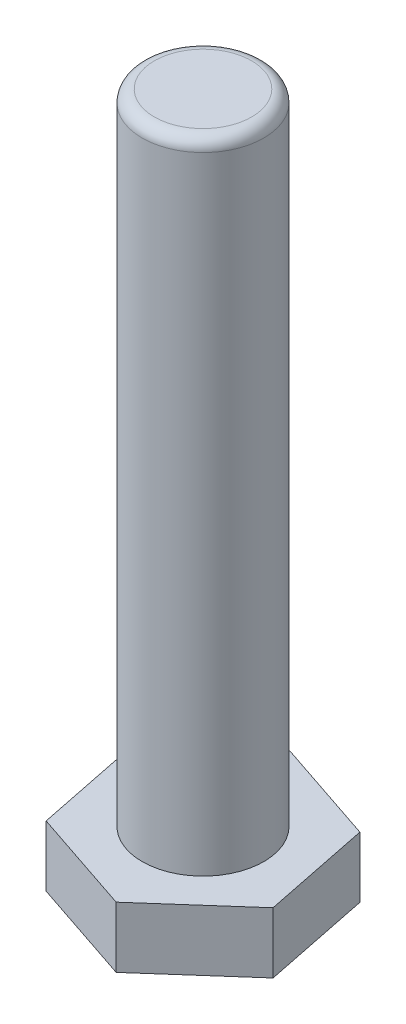
ISO-10303-21;
HEADER;
FILE_DESCRIPTION(('STEP AP214'),'2;1');
FILE_NAME('part.step','',(''),(''),'','','');
FILE_SCHEMA(('AUTOMOTIVE_DESIGN { 1 0 10303 214 1 1 1 1 }'));
ENDSEC;
DATA;
#1=APPLICATION_CONTEXT('core data for automotive mechanical design processes');
#2=APPLICATION_PROTOCOL_DEFINITION('international standard','automotive_design',2000,#1);
#3=PRODUCT_CONTEXT('',#1,'mechanical');
#4=PRODUCT('Part','Part','',(#3));
#5=PRODUCT_RELATED_PRODUCT_CATEGORY('part','',(#4));
#6=PRODUCT_DEFINITION_FORMATION('','',#4);
#7=PRODUCT_DEFINITION_CONTEXT('part definition',#1,'design');
#8=PRODUCT_DEFINITION('design','',#6,#7);
#9=PRODUCT_DEFINITION_SHAPE('','',#8);
#10=(LENGTH_UNIT() NAMED_UNIT(*) SI_UNIT(.MILLI.,.METRE.));
#11=(NAMED_UNIT(*) PLANE_ANGLE_UNIT() SI_UNIT($,.RADIAN.));
#12=(NAMED_UNIT(*) SI_UNIT($,.STERADIAN.) SOLID_ANGLE_UNIT());
#13=UNCERTAINTY_MEASURE_WITH_UNIT(LENGTH_MEASURE(1.E-05),#10,'distance_accuracy_value','');
#14=(GEOMETRIC_REPRESENTATION_CONTEXT(3) GLOBAL_UNCERTAINTY_ASSIGNED_CONTEXT((#13)) GLOBAL_UNIT_ASSIGNED_CONTEXT((#10,
#11,#12)) REPRESENTATION_CONTEXT('',''));
#15=CARTESIAN_POINT('',(0.,0.,0.));
#16=DIRECTION('',(0.,0.,1.));
#17=DIRECTION('',(1.,0.,0.));
#18=AXIS2_PLACEMENT_3D('',#15,#16,#17);
#19=CARTESIAN_POINT('',(-17.3205080756888,10.,-5.8073031005664));
#20=DIRECTION('',(0.980048111294351,0.,-0.198760407396384));
#21=DIRECTION('',(-0.198760407396384,0.,-0.980048111294351));
#22=AXIS2_PLACEMENT_3D('',#19,#20,#21);
#23=PLANE('',#22);
#24=DIRECTION('',(0.198760407396384,0.,0.980048111294351));
#25=VECTOR('',#24,1.);
#26=CARTESIAN_POINT('',(-17.3205080756888,0.,-5.8073031005664));
#27=LINE('',#26,#25);
#28=CARTESIAN_POINT('',(-17.3205080756888,0.,-5.8073031005664));
#29=VERTEX_POINT('',#28);
#30=CARTESIAN_POINT('',(-13.689526050411,0.,12.0963484497168));
#31=VERTEX_POINT('',#30);
#32=EDGE_CURVE('E122',#29,#31,#27,.T.);
#33=ORIENTED_EDGE('',*,*,#32,.T.);
#34=DIRECTION('',(0.,-1.,0.));
#35=VECTOR('',#34,1.);
#36=CARTESIAN_POINT('',(-13.689526050411,10.,12.0963484497168));
#37=LINE('',#36,#35);
#38=CARTESIAN_POINT('',(-13.689526050411,10.,12.0963484497168));
#39=VERTEX_POINT('',#38);
#40=EDGE_CURVE('E139',#39,#31,#37,.T.);
#41=ORIENTED_EDGE('',*,*,#40,.F.);
#42=DIRECTION('',(0.198760407396384,0.,0.980048111294351));
#43=VECTOR('',#42,1.);
#44=CARTESIAN_POINT('',(-17.3205080756888,10.,-5.8073031005664));
#45=LINE('',#44,#43);
#46=CARTESIAN_POINT('',(-17.3205080756888,10.,-5.8073031005664));
#47=VERTEX_POINT('',#46);
#48=EDGE_CURVE('E132',#47,#39,#45,.T.);
#49=ORIENTED_EDGE('',*,*,#48,.F.);
#50=DIRECTION('',(0.,-1.,0.));
#51=VECTOR('',#50,1.);
#52=CARTESIAN_POINT('',(-17.3205080756888,10.,-5.8073031005664));
#53=LINE('',#52,#51);
#54=EDGE_CURVE('E118',#47,#29,#53,.T.);
#55=ORIENTED_EDGE('',*,*,#54,.T.);
#56=EDGE_LOOP('',(#33,#41,#49,#55));
#57=FACE_BOUND('',#56,.T.);
#58=ADVANCED_FACE('F36',(#57),#23,.F.);
#59=CARTESIAN_POINT('',(-13.689526050411,10.,12.0963484497168));
#60=DIRECTION('',(0.317892493575363,0.,-0.948126765010058));
#61=DIRECTION('',(-0.948126765010058,0.,-0.317892493575363));
#62=AXIS2_PLACEMENT_3D('',#59,#60,#61);
#63=PLANE('',#62);
#64=DIRECTION('',(0.948126765010058,0.,0.317892493575363));
#65=VECTOR('',#64,1.);
#66=CARTESIAN_POINT('',(-13.689526050411,0.,12.0963484497168));
#67=LINE('',#66,#65);
#68=CARTESIAN_POINT('',(3.63098202527774,0.,17.9036515502832));
#69=VERTEX_POINT('',#68);
#70=EDGE_CURVE('E125',#31,#69,#67,.T.);
#71=ORIENTED_EDGE('',*,*,#70,.T.);
#72=DIRECTION('',(0.,-1.,0.));
#73=VECTOR('',#72,1.);
#74=CARTESIAN_POINT('',(3.63098202527774,10.,17.9036515502832));
#75=LINE('',#74,#73);
#76=CARTESIAN_POINT('',(3.63098202527774,10.,17.9036515502832));
#77=VERTEX_POINT('',#76);
#78=EDGE_CURVE('E136',#77,#69,#75,.T.);
#79=ORIENTED_EDGE('',*,*,#78,.F.);
#80=DIRECTION('',(0.948126765010058,0.,0.317892493575363));
#81=VECTOR('',#80,1.);
#82=CARTESIAN_POINT('',(-13.689526050411,10.,12.0963484497168));
#83=LINE('',#82,#81);
#84=EDGE_CURVE('E91',#39,#77,#83,.T.);
#85=ORIENTED_EDGE('',*,*,#84,.F.);
#86=ORIENTED_EDGE('',*,*,#40,.T.);
#87=EDGE_LOOP('',(#71,#79,#85,#86));
#88=FACE_BOUND('',#87,.T.);
#89=ADVANCED_FACE('F152',(#88),#63,.F.);
#90=CARTESIAN_POINT('',(3.63098202527774,10.,17.9036515502832));
#91=DIRECTION('',(-0.662155617718988,0.,-0.749366357613674));
#92=DIRECTION('',(-0.749366357613674,0.,0.662155617718988));
#93=AXIS2_PLACEMENT_3D('',#90,#91,#92);
#94=PLANE('',#93);
#95=DIRECTION('',(0.749366357613674,0.,-0.662155617718988));
#96=VECTOR('',#95,1.);
#97=CARTESIAN_POINT('',(3.63098202527774,0.,17.9036515502832));
#98=LINE('',#97,#96);
#99=CARTESIAN_POINT('',(17.3205080756888,0.,5.80730310056641));
#100=VERTEX_POINT('',#99);
#101=EDGE_CURVE('E127',#69,#100,#98,.T.);
#102=ORIENTED_EDGE('',*,*,#101,.T.);
#103=DIRECTION('',(0.,-1.,0.));
#104=VECTOR('',#103,1.);
#105=CARTESIAN_POINT('',(17.3205080756888,10.,5.80730310056641));
#106=LINE('',#105,#104);
#107=CARTESIAN_POINT('',(17.3205080756888,10.,5.80730310056641));
#108=VERTEX_POINT('',#107);
#109=EDGE_CURVE('E113',#108,#100,#106,.T.);
#110=ORIENTED_EDGE('',*,*,#109,.F.);
#111=DIRECTION('',(0.749366357613674,0.,-0.662155617718988));
#112=VECTOR('',#111,1.);
#113=CARTESIAN_POINT('',(3.63098202527774,10.,17.9036515502832));
#114=LINE('',#113,#112);
#115=EDGE_CURVE('E104',#77,#108,#114,.T.);
#116=ORIENTED_EDGE('',*,*,#115,.F.);
#117=ORIENTED_EDGE('',*,*,#78,.T.);
#118=EDGE_LOOP('',(#102,#110,#116,#117));
#119=FACE_BOUND('',#118,.T.);
#120=ADVANCED_FACE('F155',(#119),#94,.F.);
#121=CARTESIAN_POINT('',(17.3205080756888,10.,5.80730310056641));
#122=DIRECTION('',(-0.980048111294351,0.,0.198760407396383));
#123=DIRECTION('',(0.198760407396383,0.,0.980048111294351));
#124=AXIS2_PLACEMENT_3D('',#121,#122,#123);
#125=PLANE('',#124);
#126=DIRECTION('',(-0.198760407396383,0.,-0.98004811129435));
#127=VECTOR('',#126,1.);
#128=CARTESIAN_POINT('',(17.3205080756888,0.,5.80730310056641));
#129=LINE('',#128,#127);
#130=CARTESIAN_POINT('',(13.689526050411,0.,-12.0963484497168));
#131=VERTEX_POINT('',#130);
#132=EDGE_CURVE('E112',#100,#131,#129,.T.);
#133=ORIENTED_EDGE('',*,*,#132,.T.);
#134=DIRECTION('',(0.,-1.,0.));
#135=VECTOR('',#134,1.);
#136=CARTESIAN_POINT('',(13.689526050411,10.,-12.0963484497168));
#137=LINE('',#136,#135);
#138=CARTESIAN_POINT('',(13.689526050411,10.,-12.0963484497168));
#139=VERTEX_POINT('',#138);
#140=EDGE_CURVE('E109',#139,#131,#137,.T.);
#141=ORIENTED_EDGE('',*,*,#140,.F.);
#142=DIRECTION('',(-0.198760407396383,0.,-0.98004811129435));
#143=VECTOR('',#142,1.);
#144=CARTESIAN_POINT('',(17.3205080756888,10.,5.80730310056641));
#145=LINE('',#144,#143);
#146=EDGE_CURVE('E98',#108,#139,#145,.T.);
#147=ORIENTED_EDGE('',*,*,#146,.F.);
#148=ORIENTED_EDGE('',*,*,#109,.T.);
#149=EDGE_LOOP('',(#133,#141,#147,#148));
#150=FACE_BOUND('',#149,.T.);
#151=ADVANCED_FACE('F110',(#150),#125,.F.);
#152=CARTESIAN_POINT('',(13.689526050411,10.,-12.0963484497168));
#153=DIRECTION('',(-0.317892493575362,0.,0.948126765010058));
#154=DIRECTION('',(0.948126765010058,0.,0.317892493575362));
#155=AXIS2_PLACEMENT_3D('',#152,#153,#154);
#156=PLANE('',#155);
#157=DIRECTION('',(-0.948126765010058,0.,-0.317892493575362));
#158=VECTOR('',#157,1.);
#159=CARTESIAN_POINT('',(13.689526050411,0.,-12.0963484497168));
#160=LINE('',#159,#158);
#161=CARTESIAN_POINT('',(-3.63098202527775,0.,-17.9036515502832));
#162=VERTEX_POINT('',#161);
#163=EDGE_CURVE('E76',#131,#162,#160,.T.);
#164=ORIENTED_EDGE('',*,*,#163,.T.);
#165=DIRECTION('',(0.,-1.,0.));
#166=VECTOR('',#165,1.);
#167=CARTESIAN_POINT('',(-3.63098202527775,10.,-17.9036515502832));
#168=LINE('',#167,#166);
#169=CARTESIAN_POINT('',(-3.63098202527775,10.,-17.9036515502832));
#170=VERTEX_POINT('',#169);
#171=EDGE_CURVE('E114',#170,#162,#168,.T.);
#172=ORIENTED_EDGE('',*,*,#171,.F.);
#173=DIRECTION('',(-0.948126765010058,0.,-0.317892493575362));
#174=VECTOR('',#173,1.);
#175=CARTESIAN_POINT('',(13.689526050411,10.,-12.0963484497168));
#176=LINE('',#175,#174);
#177=EDGE_CURVE('E102',#139,#170,#176,.T.);
#178=ORIENTED_EDGE('',*,*,#177,.F.);
#179=ORIENTED_EDGE('',*,*,#140,.T.);
#180=EDGE_LOOP('',(#164,#172,#178,#179));
#181=FACE_BOUND('',#180,.T.);
#182=ADVANCED_FACE('F116',(#181),#156,.F.);
#183=CARTESIAN_POINT('',(-3.63098202527775,10.,-17.9036515502832));
#184=DIRECTION('',(0.662155617718988,0.,0.749366357613674));
#185=DIRECTION('',(0.749366357613674,0.,-0.662155617718988));
#186=AXIS2_PLACEMENT_3D('',#183,#184,#185);
#187=PLANE('',#186);
#188=DIRECTION('',(-0.749366357613674,0.,0.662155617718988));
#189=VECTOR('',#188,1.);
#190=CARTESIAN_POINT('',(-3.63098202527775,0.,-17.9036515502832));
#191=LINE('',#190,#189);
#192=EDGE_CURVE('E82',#162,#29,#191,.T.);
#193=ORIENTED_EDGE('',*,*,#192,.T.);
#194=ORIENTED_EDGE('',*,*,#54,.F.);
#195=DIRECTION('',(-0.749366357613674,0.,0.662155617718988));
#196=VECTOR('',#195,1.);
#197=CARTESIAN_POINT('',(-3.63098202527775,10.,-17.9036515502832));
#198=LINE('',#197,#196);
#199=EDGE_CURVE('E53',#170,#47,#198,.T.);
#200=ORIENTED_EDGE('',*,*,#199,.F.);
#201=ORIENTED_EDGE('',*,*,#171,.T.);
#202=EDGE_LOOP('',(#193,#194,#200,#201));
#203=FACE_BOUND('',#202,.T.);
#204=ADVANCED_FACE('F160',(#203),#187,.F.);
#205=CARTESIAN_POINT('',(0.,10.,0.));
#206=DIRECTION('',(0.,1.,0.));
#207=DIRECTION('',(0.,0.,1.));
#208=AXIS2_PLACEMENT_3D('',#205,#206,#207);
#209=PLANE('',#208);
#210=CARTESIAN_POINT('',(0.,10.,0.));
#211=DIRECTION('',(0.,1.,0.));
#212=DIRECTION('',(0.,0.,1.));
#213=AXIS2_PLACEMENT_3D('',#210,#211,#212);
#214=CIRCLE('',#213,10.);
#215=CARTESIAN_POINT('',(0.,10.,10.));
#216=VERTEX_POINT('',#215);
#217=EDGE_CURVE('E140',#216,#216,#214,.T.);
#218=ORIENTED_EDGE('',*,*,#217,.F.);
#219=EDGE_LOOP('',(#218));
#220=FACE_BOUND('',#219,.T.);
#221=ORIENTED_EDGE('',*,*,#48,.T.);
#222=ORIENTED_EDGE('',*,*,#84,.T.);
#223=ORIENTED_EDGE('',*,*,#115,.T.);
#224=ORIENTED_EDGE('',*,*,#146,.T.);
#225=ORIENTED_EDGE('',*,*,#177,.T.);
#226=ORIENTED_EDGE('',*,*,#199,.T.);
#227=EDGE_LOOP('',(#221,#222,#223,#224,#225,#226));
#228=FACE_BOUND('',#227,.T.);
#229=ADVANCED_FACE('F100',(#220,#228),#209,.T.);
#230=CARTESIAN_POINT('',(0.,0.,0.));
#231=DIRECTION('',(0.,1.,0.));
#232=DIRECTION('',(0.,0.,1.));
#233=AXIS2_PLACEMENT_3D('',#230,#231,#232);
#234=PLANE('',#233);
#235=ORIENTED_EDGE('',*,*,#32,.F.);
#236=ORIENTED_EDGE('',*,*,#192,.F.);
#237=ORIENTED_EDGE('',*,*,#163,.F.);
#238=ORIENTED_EDGE('',*,*,#132,.F.);
#239=ORIENTED_EDGE('',*,*,#101,.F.);
#240=ORIENTED_EDGE('',*,*,#70,.F.);
#241=EDGE_LOOP('',(#235,#236,#237,#238,#239,#240));
#242=FACE_BOUND('',#241,.T.);
#243=ADVANCED_FACE('F158',(#242),#234,.F.);
#244=CARTESIAN_POINT('',(0.,115.,0.));
#245=DIRECTION('',(0.,-1.,0.));
#246=DIRECTION('',(0.,0.,-1.));
#247=AXIS2_PLACEMENT_3D('',#244,#245,#246);
#248=CYLINDRICAL_SURFACE('',#247,10.);
#249=CARTESIAN_POINT('',(0.,113.,0.));
#250=DIRECTION('',(0.,1.,0.));
#251=DIRECTION('',(0.,0.,1.));
#252=AXIS2_PLACEMENT_3D('',#249,#250,#251);
#253=CIRCLE('',#252,10.);
#254=CARTESIAN_POINT('',(0.,113.,10.));
#255=VERTEX_POINT('',#254);
#256=EDGE_CURVE('E11',#255,#255,#253,.F.);
#257=ORIENTED_EDGE('',*,*,#256,.T.);
#258=EDGE_LOOP('',(#257));
#259=FACE_BOUND('',#258,.T.);
#260=ORIENTED_EDGE('',*,*,#217,.T.);
#261=EDGE_LOOP('',(#260));
#262=FACE_BOUND('',#261,.T.);
#263=ADVANCED_FACE('F202',(#259,#262),#248,.T.);
#264=CARTESIAN_POINT('',(0.,115.,0.));
#265=DIRECTION('',(0.,1.,0.));
#266=DIRECTION('',(0.,0.,1.));
#267=AXIS2_PLACEMENT_3D('',#264,#265,#266);
#268=PLANE('',#267);
#269=CARTESIAN_POINT('',(0.,115.,0.));
#270=DIRECTION('',(0.,1.,0.));
#271=DIRECTION('',(0.,0.,1.));
#272=AXIS2_PLACEMENT_3D('',#269,#270,#271);
#273=CIRCLE('',#272,8.);
#274=CARTESIAN_POINT('',(0.,115.,8.));
#275=VERTEX_POINT('',#274);
#276=EDGE_CURVE('E45',#275,#275,#273,.T.);
#277=ORIENTED_EDGE('',*,*,#276,.T.);
#278=EDGE_LOOP('',(#277));
#279=FACE_BOUND('',#278,.T.);
#280=ADVANCED_FACE('F216',(#279),#268,.T.);
#281=CARTESIAN_POINT('',(0.,113.,0.));
#282=DIRECTION('',(0.,1.,0.));
#283=DIRECTION('',(0.,0.,1.));
#284=AXIS2_PLACEMENT_3D('',#281,#282,#283);
#285=TOROIDAL_SURFACE('',#284,8.,2.);
#286=ORIENTED_EDGE('',*,*,#256,.F.);
#287=EDGE_LOOP('',(#286));
#288=FACE_BOUND('',#287,.T.);
#289=ORIENTED_EDGE('',*,*,#276,.F.);
#290=EDGE_LOOP('',(#289));
#291=FACE_BOUND('',#290,.T.);
#292=ADVANCED_FACE('F38',(#288,#291),#285,.T.);
#293=CLOSED_SHELL('',(#58,#89,#120,#151,#182,#204,#229,#243,#263,#280,#292));
#294=MANIFOLD_SOLID_BREP('B2',#293);
#295=ADVANCED_BREP_SHAPE_REPRESENTATION('',(#18,#294),#14);
#296=SHAPE_DEFINITION_REPRESENTATION(#9,#295);
ENDSEC;
END-ISO-10303-21;
